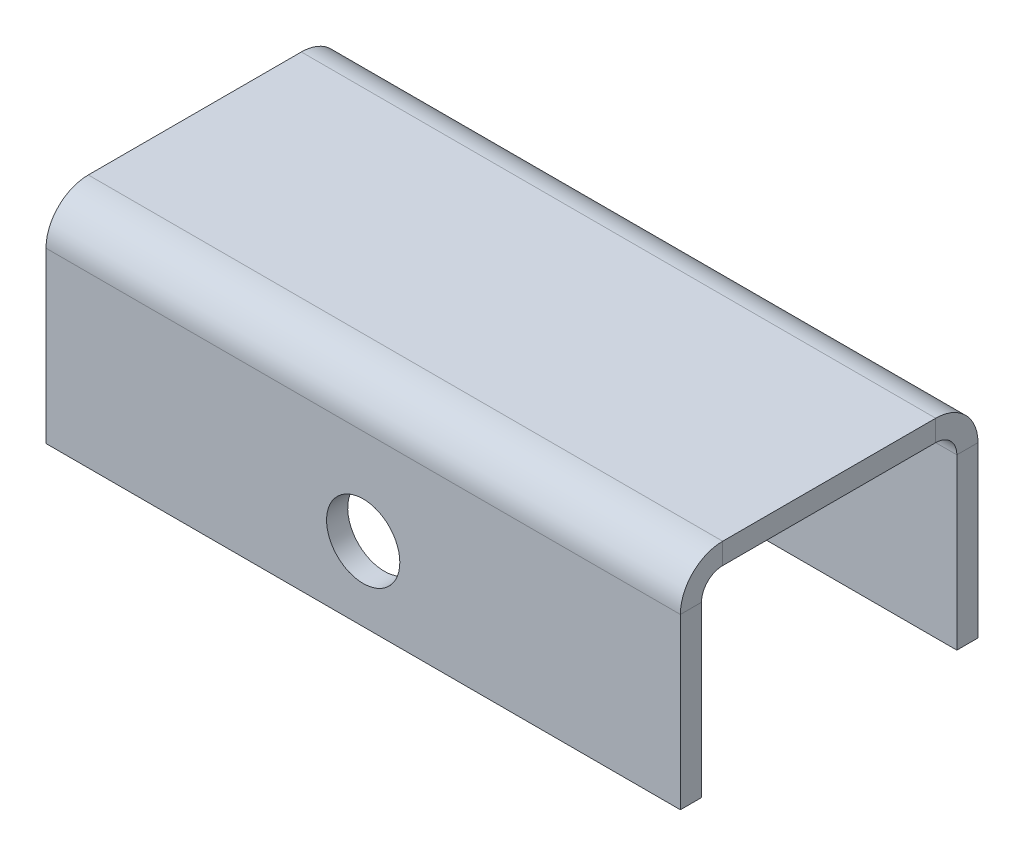
ISO-10303-21;
HEADER;
FILE_DESCRIPTION(('STEP AP214'),'2;1');
FILE_NAME('part.step','',(''),(''),'','','');
FILE_SCHEMA(('AUTOMOTIVE_DESIGN { 1 0 10303 214 1 1 1 1 }'));
ENDSEC;
DATA;
#1=APPLICATION_CONTEXT('core data for automotive mechanical design processes');
#2=APPLICATION_PROTOCOL_DEFINITION('international standard','automotive_design',2000,#1);
#3=PRODUCT_CONTEXT('',#1,'mechanical');
#4=PRODUCT('Part','Part','',(#3));
#5=PRODUCT_RELATED_PRODUCT_CATEGORY('part','',(#4));
#6=PRODUCT_DEFINITION_FORMATION('','',#4);
#7=PRODUCT_DEFINITION_CONTEXT('part definition',#1,'design');
#8=PRODUCT_DEFINITION('design','',#6,#7);
#9=PRODUCT_DEFINITION_SHAPE('','',#8);
#10=(LENGTH_UNIT() NAMED_UNIT(*) SI_UNIT(.MILLI.,.METRE.));
#11=(NAMED_UNIT(*) PLANE_ANGLE_UNIT() SI_UNIT($,.RADIAN.));
#12=(NAMED_UNIT(*) SI_UNIT($,.STERADIAN.) SOLID_ANGLE_UNIT());
#13=UNCERTAINTY_MEASURE_WITH_UNIT(LENGTH_MEASURE(1.E-05),#10,'distance_accuracy_value','');
#14=(GEOMETRIC_REPRESENTATION_CONTEXT(3) GLOBAL_UNCERTAINTY_ASSIGNED_CONTEXT((#13)) GLOBAL_UNIT_ASSIGNED_CONTEXT((#10,
#11,#12)) REPRESENTATION_CONTEXT('',''));
#15=CARTESIAN_POINT('',(0.,0.,0.));
#16=DIRECTION('',(0.,0.,1.));
#17=DIRECTION('',(1.,0.,0.));
#18=AXIS2_PLACEMENT_3D('',#15,#16,#17);
#19=CARTESIAN_POINT('',(0.,-2.54,0.));
#20=DIRECTION('',(0.,1.,0.));
#21=DIRECTION('',(0.,0.,1.));
#22=AXIS2_PLACEMENT_3D('',#19,#20,#21);
#23=PLANE('',#22);
#24=DIRECTION('',(1.,0.,0.));
#25=VECTOR('',#24,1.);
#26=CARTESIAN_POINT('',(75.2470588235294,-2.54,4.58735294117646));
#27=LINE('',#26,#25);
#28=CARTESIAN_POINT('',(75.2470588235294,-2.54,4.58735294117646));
#29=VERTEX_POINT('',#28);
#30=CARTESIAN_POINT('',(-0.952941176470587,-2.54000000000001,4.58735294117646));
#31=VERTEX_POINT('',#30);
#32=EDGE_CURVE('E224',#29,#31,#27,.F.);
#33=ORIENTED_EDGE('',*,*,#32,.F.);
#34=DIRECTION('',(0.,0.,-1.));
#35=VECTOR('',#34,1.);
#36=CARTESIAN_POINT('',(75.2470588235294,-2.54,-0.492647058823529));
#37=LINE('',#36,#35);
#38=CARTESIAN_POINT('',(75.2470588235294,-2.53999999999999,30.1773529411765));
#39=VERTEX_POINT('',#38);
#40=EDGE_CURVE('E13',#39,#29,#37,.T.);
#41=ORIENTED_EDGE('',*,*,#40,.F.);
#42=DIRECTION('',(-1.,0.,0.));
#43=VECTOR('',#42,1.);
#44=CARTESIAN_POINT('',(-0.952941176470587,-2.53999999999999,30.1773529411765));
#45=LINE('',#44,#43);
#46=CARTESIAN_POINT('',(-0.952941176470586,-2.53999999999999,30.1773529411765));
#47=VERTEX_POINT('',#46);
#48=EDGE_CURVE('E275',#47,#39,#45,.F.);
#49=ORIENTED_EDGE('',*,*,#48,.F.);
#50=DIRECTION('',(0.,0.,1.));
#51=VECTOR('',#50,1.);
#52=CARTESIAN_POINT('',(-0.952941176470588,-2.54,-0.492647058823529));
#53=LINE('',#52,#51);
#54=EDGE_CURVE('E88',#31,#47,#53,.T.);
#55=ORIENTED_EDGE('',*,*,#54,.F.);
#56=EDGE_LOOP('',(#33,#41,#49,#55));
#57=FACE_BOUND('',#56,.T.);
#58=ADVANCED_FACE('F79',(#57),#23,.F.);
#59=CARTESIAN_POINT('',(0.,0.,0.));
#60=DIRECTION('',(0.,1.,0.));
#61=DIRECTION('',(0.,0.,1.));
#62=AXIS2_PLACEMENT_3D('',#59,#60,#61);
#63=PLANE('',#62);
#64=DIRECTION('',(0.,0.,-1.));
#65=VECTOR('',#64,1.);
#66=CARTESIAN_POINT('',(75.2470588235294,0.,-0.492647058823529));
#67=LINE('',#66,#65);
#68=CARTESIAN_POINT('',(75.2470588235294,0.,30.1773529411765));
#69=VERTEX_POINT('',#68);
#70=CARTESIAN_POINT('',(75.2470588235294,0.,4.58735294117646));
#71=VERTEX_POINT('',#70);
#72=EDGE_CURVE('E285',#69,#71,#67,.T.);
#73=ORIENTED_EDGE('',*,*,#72,.T.);
#74=DIRECTION('',(1.,0.,0.));
#75=VECTOR('',#74,1.);
#76=CARTESIAN_POINT('',(75.2470588235294,0.,4.58735294117646));
#77=LINE('',#76,#75);
#78=CARTESIAN_POINT('',(-0.952941176470587,0.,4.58735294117646));
#79=VERTEX_POINT('',#78);
#80=EDGE_CURVE('E213',#71,#79,#77,.F.);
#81=ORIENTED_EDGE('',*,*,#80,.T.);
#82=DIRECTION('',(0.,0.,1.));
#83=VECTOR('',#82,1.);
#84=CARTESIAN_POINT('',(-0.952941176470588,0.,-0.492647058823529));
#85=LINE('',#84,#83);
#86=CARTESIAN_POINT('',(-0.952941176470586,0.,30.1773529411765));
#87=VERTEX_POINT('',#86);
#88=EDGE_CURVE('E281',#79,#87,#85,.T.);
#89=ORIENTED_EDGE('',*,*,#88,.T.);
#90=DIRECTION('',(-1.,0.,0.));
#91=VECTOR('',#90,1.);
#92=CARTESIAN_POINT('',(-0.952941176470587,0.,30.1773529411765));
#93=LINE('',#92,#91);
#94=EDGE_CURVE('E264',#87,#69,#93,.F.);
#95=ORIENTED_EDGE('',*,*,#94,.T.);
#96=EDGE_LOOP('',(#73,#81,#89,#95));
#97=FACE_BOUND('',#96,.T.);
#98=ADVANCED_FACE('F291',(#97),#63,.T.);
#99=CARTESIAN_POINT('',(75.2470588235294,-2.54,-0.492647058823529));
#100=DIRECTION('',(1.,0.,0.));
#101=DIRECTION('',(0.,0.,-1.));
#102=AXIS2_PLACEMENT_3D('',#99,#100,#101);
#103=PLANE('',#102);
#104=ORIENTED_EDGE('',*,*,#40,.T.);
#105=DIRECTION('',(0.,1.,0.));
#106=VECTOR('',#105,1.);
#107=CARTESIAN_POINT('',(75.2470588235294,-2.54,4.58735294117646));
#108=LINE('',#107,#106);
#109=EDGE_CURVE('E218',#29,#71,#108,.T.);
#110=ORIENTED_EDGE('',*,*,#109,.T.);
#111=ORIENTED_EDGE('',*,*,#72,.F.);
#112=DIRECTION('',(0.,1.,0.));
#113=VECTOR('',#112,1.);
#114=CARTESIAN_POINT('',(75.2470588235294,-2.53999999999999,30.1773529411765));
#115=LINE('',#114,#113);
#116=EDGE_CURVE('E279',#39,#69,#115,.T.);
#117=ORIENTED_EDGE('',*,*,#116,.F.);
#118=EDGE_LOOP('',(#104,#110,#111,#117));
#119=FACE_BOUND('',#118,.T.);
#120=ADVANCED_FACE('F295',(#119),#103,.T.);
#121=CARTESIAN_POINT('',(-0.952941176470588,-2.54,-0.492647058823529));
#122=DIRECTION('',(-1.,0.,0.));
#123=DIRECTION('',(0.,0.,1.));
#124=AXIS2_PLACEMENT_3D('',#121,#122,#123);
#125=PLANE('',#124);
#126=DIRECTION('',(0.,1.,0.));
#127=VECTOR('',#126,1.);
#128=CARTESIAN_POINT('',(-0.952941176470587,-2.54000000000001,4.58735294117646));
#129=LINE('',#128,#127);
#130=EDGE_CURVE('E229',#31,#79,#129,.T.);
#131=ORIENTED_EDGE('',*,*,#130,.F.);
#132=ORIENTED_EDGE('',*,*,#54,.T.);
#133=DIRECTION('',(0.,1.,0.));
#134=VECTOR('',#133,1.);
#135=CARTESIAN_POINT('',(-0.952941176470586,-2.53999999999999,30.1773529411765));
#136=LINE('',#135,#134);
#137=EDGE_CURVE('E269',#47,#87,#136,.T.);
#138=ORIENTED_EDGE('',*,*,#137,.T.);
#139=ORIENTED_EDGE('',*,*,#88,.F.);
#140=EDGE_LOOP('',(#131,#132,#138,#139));
#141=FACE_BOUND('',#140,.T.);
#142=ADVANCED_FACE('F81',(#141),#125,.T.);
#143=CARTESIAN_POINT('',(75.2470588235294,-5.07999999999999,30.1773529411765));
#144=DIRECTION('',(1.,0.,0.));
#145=DIRECTION('',(0.,0.,-1.));
#146=AXIS2_PLACEMENT_3D('',#143,#144,#145);
#147=PLANE('',#146);
#148=DIRECTION('',(0.,0.,-1.));
#149=VECTOR('',#148,1.);
#150=CARTESIAN_POINT('',(75.2470588235294,-5.07999999999999,35.2573529411765));
#151=LINE('',#150,#149);
#152=CARTESIAN_POINT('',(75.2470588235294,-5.07999999999998,32.7173529411765));
#153=VERTEX_POINT('',#152);
#154=CARTESIAN_POINT('',(75.2470588235294,-5.07999999999998,35.2573529411765));
#155=VERTEX_POINT('',#154);
#156=EDGE_CURVE('E231',#153,#155,#151,.F.);
#157=ORIENTED_EDGE('',*,*,#156,.F.);
#158=CARTESIAN_POINT('',(75.2470588235294,-5.07999999999999,30.1773529411765));
#159=DIRECTION('',(-1.,0.,0.));
#160=DIRECTION('',(0.,0.,1.));
#161=AXIS2_PLACEMENT_3D('',#158,#159,#160);
#162=CIRCLE('',#161,2.54);
#163=EDGE_CURVE('E272',#39,#153,#162,.F.);
#164=ORIENTED_EDGE('',*,*,#163,.F.);
#165=ORIENTED_EDGE('',*,*,#116,.T.);
#166=CARTESIAN_POINT('',(75.2470588235294,-5.07999999999999,30.1773529411765));
#167=DIRECTION('',(-1.,0.,0.));
#168=DIRECTION('',(0.,0.,1.));
#169=AXIS2_PLACEMENT_3D('',#166,#167,#168);
#170=CIRCLE('',#169,5.08);
#171=EDGE_CURVE('E96',#69,#155,#170,.F.);
#172=ORIENTED_EDGE('',*,*,#171,.T.);
#173=EDGE_LOOP('',(#157,#164,#165,#172));
#174=FACE_BOUND('',#173,.T.);
#175=ADVANCED_FACE('F341',(#174),#147,.T.);
#176=CARTESIAN_POINT('',(-0.952941176470586,-5.07999999999999,30.1773529411765));
#177=DIRECTION('',(1.,0.,0.));
#178=DIRECTION('',(0.,0.,-1.));
#179=AXIS2_PLACEMENT_3D('',#176,#177,#178);
#180=PLANE('',#179);
#181=CARTESIAN_POINT('',(-0.952941176470586,-5.07999999999999,30.1773529411765));
#182=DIRECTION('',(-1.,0.,0.));
#183=DIRECTION('',(0.,0.,1.));
#184=AXIS2_PLACEMENT_3D('',#181,#182,#183);
#185=CIRCLE('',#184,2.54);
#186=CARTESIAN_POINT('',(-0.952941176470586,-5.07999999999998,32.7173529411765));
#187=VERTEX_POINT('',#186);
#188=EDGE_CURVE('E237',#187,#47,#185,.T.);
#189=ORIENTED_EDGE('',*,*,#188,.F.);
#190=DIRECTION('',(0.,0.,-1.));
#191=VECTOR('',#190,1.);
#192=CARTESIAN_POINT('',(-0.952941176470587,-5.07999999999999,32.7173529411765));
#193=LINE('',#192,#191);
#194=CARTESIAN_POINT('',(-0.952941176470586,-5.07999999999999,35.2573529411765));
#195=VERTEX_POINT('',#194);
#196=EDGE_CURVE('E257',#187,#195,#193,.F.);
#197=ORIENTED_EDGE('',*,*,#196,.T.);
#198=CARTESIAN_POINT('',(-0.952941176470586,-5.07999999999999,30.1773529411765));
#199=DIRECTION('',(-1.,0.,0.));
#200=DIRECTION('',(0.,0.,1.));
#201=AXIS2_PLACEMENT_3D('',#198,#199,#200);
#202=CIRCLE('',#201,5.08);
#203=EDGE_CURVE('E267',#195,#87,#202,.T.);
#204=ORIENTED_EDGE('',*,*,#203,.T.);
#205=ORIENTED_EDGE('',*,*,#137,.F.);
#206=EDGE_LOOP('',(#189,#197,#204,#205));
#207=FACE_BOUND('',#206,.T.);
#208=ADVANCED_FACE('F335',(#207),#180,.F.);
#209=CARTESIAN_POINT('',(-0.952941176470587,-5.07999999999999,30.1773529411765));
#210=DIRECTION('',(-1.,0.,0.));
#211=DIRECTION('',(0.,0.,1.));
#212=AXIS2_PLACEMENT_3D('',#209,#210,#211);
#213=CYLINDRICAL_SURFACE('',#212,5.08);
#214=ORIENTED_EDGE('',*,*,#94,.F.);
#215=ORIENTED_EDGE('',*,*,#203,.F.);
#216=DIRECTION('',(-1.,0.,0.));
#217=VECTOR('',#216,1.);
#218=CARTESIAN_POINT('',(75.2470588235294,-5.07999999999999,35.2573529411765));
#219=LINE('',#218,#217);
#220=EDGE_CURVE('E255',#195,#155,#219,.F.);
#221=ORIENTED_EDGE('',*,*,#220,.T.);
#222=ORIENTED_EDGE('',*,*,#171,.F.);
#223=EDGE_LOOP('',(#214,#215,#221,#222));
#224=FACE_BOUND('',#223,.T.);
#225=ADVANCED_FACE('F349',(#224),#213,.T.);
#226=CARTESIAN_POINT('',(-0.952941176470587,-5.07999999999999,30.1773529411765));
#227=DIRECTION('',(-1.,0.,0.));
#228=DIRECTION('',(0.,0.,1.));
#229=AXIS2_PLACEMENT_3D('',#226,#227,#228);
#230=CYLINDRICAL_SURFACE('',#229,2.54);
#231=ORIENTED_EDGE('',*,*,#48,.T.);
#232=ORIENTED_EDGE('',*,*,#163,.T.);
#233=DIRECTION('',(-1.,0.,0.));
#234=VECTOR('',#233,1.);
#235=CARTESIAN_POINT('',(75.2470588235294,-5.07999999999999,32.7173529411765));
#236=LINE('',#235,#234);
#237=EDGE_CURVE('E260',#153,#187,#236,.T.);
#238=ORIENTED_EDGE('',*,*,#237,.T.);
#239=ORIENTED_EDGE('',*,*,#188,.T.);
#240=EDGE_LOOP('',(#231,#232,#238,#239));
#241=FACE_BOUND('',#240,.T.);
#242=ADVANCED_FACE('F352',(#241),#230,.F.);
#243=CARTESIAN_POINT('',(-0.95294117647057,-25.4,35.2573529411765));
#244=DIRECTION('',(1.,0.,0.));
#245=DIRECTION('',(0.,1.,0.));
#246=AXIS2_PLACEMENT_3D('',#243,#244,#245);
#247=PLANE('',#246);
#248=ORIENTED_EDGE('',*,*,#196,.F.);
#249=DIRECTION('',(0.,1.,0.));
#250=VECTOR('',#249,1.);
#251=CARTESIAN_POINT('',(-0.95294117647057,-25.4,32.7173529411766));
#252=LINE('',#251,#250);
#253=CARTESIAN_POINT('',(-0.952941176470572,-25.4,32.7173529411766));
#254=VERTEX_POINT('',#253);
#255=EDGE_CURVE('E253',#187,#254,#252,.F.);
#256=ORIENTED_EDGE('',*,*,#255,.T.);
#257=DIRECTION('',(0.,0.,-1.));
#258=VECTOR('',#257,1.);
#259=CARTESIAN_POINT('',(-0.952941176470573,-25.4,35.2573529411765));
#260=LINE('',#259,#258);
#261=CARTESIAN_POINT('',(-0.952941176470572,-25.4,35.2573529411765));
#262=VERTEX_POINT('',#261);
#263=EDGE_CURVE('E234',#262,#254,#260,.T.);
#264=ORIENTED_EDGE('',*,*,#263,.F.);
#265=DIRECTION('',(0.,-1.,0.));
#266=VECTOR('',#265,1.);
#267=CARTESIAN_POINT('',(-0.952941176470585,1.36727050943836E-13,35.2573529411765));
#268=LINE('',#267,#266);
#269=EDGE_CURVE('E246',#195,#262,#268,.T.);
#270=ORIENTED_EDGE('',*,*,#269,.F.);
#271=EDGE_LOOP('',(#248,#256,#264,#270));
#272=FACE_BOUND('',#271,.T.);
#273=ADVANCED_FACE('F355',(#272),#247,.F.);
#274=CARTESIAN_POINT('',(75.2470588235294,-2.53999999999999,35.2573529411765));
#275=DIRECTION('',(-1.,0.,0.));
#276=DIRECTION('',(0.,0.,1.));
#277=AXIS2_PLACEMENT_3D('',#274,#275,#276);
#278=PLANE('',#277);
#279=ORIENTED_EDGE('',*,*,#156,.T.);
#280=DIRECTION('',(0.,1.,0.));
#281=VECTOR('',#280,1.);
#282=CARTESIAN_POINT('',(75.2470588235294,1.37292001126349E-13,35.2573529411765));
#283=LINE('',#282,#281);
#284=CARTESIAN_POINT('',(75.2470588235294,-25.4,35.2573529411765));
#285=VERTEX_POINT('',#284);
#286=EDGE_CURVE('E241',#285,#155,#283,.T.);
#287=ORIENTED_EDGE('',*,*,#286,.F.);
#288=DIRECTION('',(0.,0.,-1.));
#289=VECTOR('',#288,1.);
#290=CARTESIAN_POINT('',(75.2470588235294,-25.4,35.2573529411765));
#291=LINE('',#290,#289);
#292=CARTESIAN_POINT('',(75.2470588235294,-25.4,32.7173529411766));
#293=VERTEX_POINT('',#292);
#294=EDGE_CURVE('E238',#285,#293,#291,.T.);
#295=ORIENTED_EDGE('',*,*,#294,.T.);
#296=DIRECTION('',(0.,-1.,0.));
#297=VECTOR('',#296,1.);
#298=CARTESIAN_POINT('',(75.2470588235294,-2.54,32.7173529411765));
#299=LINE('',#298,#297);
#300=EDGE_CURVE('E248',#293,#153,#299,.F.);
#301=ORIENTED_EDGE('',*,*,#300,.T.);
#302=EDGE_LOOP('',(#279,#287,#295,#301));
#303=FACE_BOUND('',#302,.T.);
#304=ADVANCED_FACE('F361',(#303),#278,.F.);
#305=CARTESIAN_POINT('',(0.,1.37292001126349E-13,35.2573529411765));
#306=DIRECTION('',(0.,0.,-1.));
#307=DIRECTION('',(0.,1.,0.));
#308=AXIS2_PLACEMENT_3D('',#305,#306,#307);
#309=PLANE('',#308);
#310=CARTESIAN_POINT('',(37.1470588235294,-16.51,35.2573529411765));
#311=DIRECTION('',(0.,0.,1.));
#312=DIRECTION('',(1.,0.,0.));
#313=AXIS2_PLACEMENT_3D('',#310,#311,#312);
#314=CIRCLE('',#313,4.4);
#315=CARTESIAN_POINT('',(41.5470588235294,-16.51,35.2573529411765));
#316=VERTEX_POINT('',#315);
#317=EDGE_CURVE('E628',#316,#316,#314,.T.);
#318=ORIENTED_EDGE('',*,*,#317,.F.);
#319=EDGE_LOOP('',(#318));
#320=FACE_BOUND('',#319,.T.);
#321=ORIENTED_EDGE('',*,*,#220,.F.);
#322=ORIENTED_EDGE('',*,*,#269,.T.);
#323=DIRECTION('',(1.,0.,0.));
#324=VECTOR('',#323,1.);
#325=CARTESIAN_POINT('',(0.,-25.4,35.2573529411765));
#326=LINE('',#325,#324);
#327=EDGE_CURVE('E244',#262,#285,#326,.T.);
#328=ORIENTED_EDGE('',*,*,#327,.T.);
#329=ORIENTED_EDGE('',*,*,#286,.T.);
#330=EDGE_LOOP('',(#321,#322,#328,#329));
#331=FACE_BOUND('',#330,.T.);
#332=ADVANCED_FACE('F370',(#320,#331),#309,.F.);
#333=CARTESIAN_POINT('',(0.,1.28423638525688E-13,32.7173529411765));
#334=DIRECTION('',(0.,0.,-1.));
#335=DIRECTION('',(0.,1.,0.));
#336=AXIS2_PLACEMENT_3D('',#333,#334,#335);
#337=PLANE('',#336);
#338=CARTESIAN_POINT('',(37.1470588235294,-16.51,32.7173529411765));
#339=DIRECTION('',(0.,0.,-1.));
#340=DIRECTION('',(0.,1.,0.));
#341=AXIS2_PLACEMENT_3D('',#338,#339,#340);
#342=CIRCLE('',#341,4.4);
#343=CARTESIAN_POINT('',(37.1470588235294,-12.11,32.7173529411765));
#344=VERTEX_POINT('',#343);
#345=EDGE_CURVE('E212',#344,#344,#342,.T.);
#346=ORIENTED_EDGE('',*,*,#345,.F.);
#347=EDGE_LOOP('',(#346));
#348=FACE_BOUND('',#347,.T.);
#349=ORIENTED_EDGE('',*,*,#255,.F.);
#350=ORIENTED_EDGE('',*,*,#237,.F.);
#351=ORIENTED_EDGE('',*,*,#300,.F.);
#352=DIRECTION('',(-1.,0.,0.));
#353=VECTOR('',#352,1.);
#354=CARTESIAN_POINT('',(75.2470588235294,-25.4,32.7173529411766));
#355=LINE('',#354,#353);
#356=EDGE_CURVE('E251',#254,#293,#355,.F.);
#357=ORIENTED_EDGE('',*,*,#356,.F.);
#358=EDGE_LOOP('',(#349,#350,#351,#357));
#359=FACE_BOUND('',#358,.T.);
#360=ADVANCED_FACE('F366',(#348,#359),#337,.T.);
#361=CARTESIAN_POINT('',(75.2470588235294,-25.4,35.2573529411765));
#362=DIRECTION('',(0.,1.,0.));
#363=DIRECTION('',(0.,0.,1.));
#364=AXIS2_PLACEMENT_3D('',#361,#362,#363);
#365=PLANE('',#364);
#366=ORIENTED_EDGE('',*,*,#356,.T.);
#367=ORIENTED_EDGE('',*,*,#294,.F.);
#368=ORIENTED_EDGE('',*,*,#327,.F.);
#369=ORIENTED_EDGE('',*,*,#263,.T.);
#370=EDGE_LOOP('',(#366,#367,#368,#369));
#371=FACE_BOUND('',#370,.T.);
#372=ADVANCED_FACE('F363',(#371),#365,.F.);
#373=CARTESIAN_POINT('',(-0.952941176470587,-5.08000000000001,4.58735294117646));
#374=DIRECTION('',(-1.,0.,0.));
#375=DIRECTION('',(0.,-1.,0.));
#376=AXIS2_PLACEMENT_3D('',#373,#374,#375);
#377=PLANE('',#376);
#378=DIRECTION('',(0.,0.,1.));
#379=VECTOR('',#378,1.);
#380=CARTESIAN_POINT('',(-0.952941176470588,-5.07999999999997,-0.492647058823547));
#381=LINE('',#380,#379);
#382=CARTESIAN_POINT('',(-0.952941176470587,-5.08000000000001,2.04735294117646));
#383=VERTEX_POINT('',#382);
#384=CARTESIAN_POINT('',(-0.952941176470587,-5.08,-0.492647058823538));
#385=VERTEX_POINT('',#384);
#386=EDGE_CURVE('E194',#383,#385,#381,.F.);
#387=ORIENTED_EDGE('',*,*,#386,.F.);
#388=CARTESIAN_POINT('',(-0.952941176470587,-5.08000000000001,4.58735294117646));
#389=DIRECTION('',(1.,0.,0.));
#390=DIRECTION('',(0.,1.,0.));
#391=AXIS2_PLACEMENT_3D('',#388,#389,#390);
#392=CIRCLE('',#391,2.54);
#393=EDGE_CURVE('E221',#31,#383,#392,.F.);
#394=ORIENTED_EDGE('',*,*,#393,.F.);
#395=ORIENTED_EDGE('',*,*,#130,.T.);
#396=CARTESIAN_POINT('',(-0.952941176470587,-5.08000000000001,4.58735294117646));
#397=DIRECTION('',(1.,0.,0.));
#398=DIRECTION('',(0.,1.,0.));
#399=AXIS2_PLACEMENT_3D('',#396,#397,#398);
#400=CIRCLE('',#399,5.08);
#401=EDGE_CURVE('E104',#79,#385,#400,.F.);
#402=ORIENTED_EDGE('',*,*,#401,.T.);
#403=EDGE_LOOP('',(#387,#394,#395,#402));
#404=FACE_BOUND('',#403,.T.);
#405=ADVANCED_FACE('F312',(#404),#377,.T.);
#406=CARTESIAN_POINT('',(75.2470588235294,-5.08,4.58735294117646));
#407=DIRECTION('',(-1.,0.,0.));
#408=DIRECTION('',(0.,-1.,0.));
#409=AXIS2_PLACEMENT_3D('',#406,#407,#408);
#410=PLANE('',#409);
#411=CARTESIAN_POINT('',(75.2470588235294,-5.08,4.58735294117646));
#412=DIRECTION('',(1.,0.,0.));
#413=DIRECTION('',(0.,1.,0.));
#414=AXIS2_PLACEMENT_3D('',#411,#412,#413);
#415=CIRCLE('',#414,2.54);
#416=CARTESIAN_POINT('',(75.2470588235294,-5.07999999999999,2.04735294117646));
#417=VERTEX_POINT('',#416);
#418=EDGE_CURVE('E226',#417,#29,#415,.T.);
#419=ORIENTED_EDGE('',*,*,#418,.F.);
#420=DIRECTION('',(0.,0.,1.));
#421=VECTOR('',#420,1.);
#422=CARTESIAN_POINT('',(75.2470588235294,-5.07999999999999,2.04735294117646));
#423=LINE('',#422,#421);
#424=CARTESIAN_POINT('',(75.2470588235294,-5.07999999999997,-0.492647058823538));
#425=VERTEX_POINT('',#424);
#426=EDGE_CURVE('E206',#417,#425,#423,.F.);
#427=ORIENTED_EDGE('',*,*,#426,.T.);
#428=CARTESIAN_POINT('',(75.2470588235294,-5.08,4.58735294117646));
#429=DIRECTION('',(1.,0.,0.));
#430=DIRECTION('',(0.,1.,0.));
#431=AXIS2_PLACEMENT_3D('',#428,#429,#430);
#432=CIRCLE('',#431,5.08);
#433=EDGE_CURVE('E216',#425,#71,#432,.T.);
#434=ORIENTED_EDGE('',*,*,#433,.T.);
#435=ORIENTED_EDGE('',*,*,#109,.F.);
#436=EDGE_LOOP('',(#419,#427,#434,#435));
#437=FACE_BOUND('',#436,.T.);
#438=ADVANCED_FACE('F299',(#437),#410,.F.);
#439=CARTESIAN_POINT('',(75.2470588235294,-5.08,4.58735294117646));
#440=DIRECTION('',(1.,0.,0.));
#441=DIRECTION('',(0.,0.,-1.));
#442=AXIS2_PLACEMENT_3D('',#439,#440,#441);
#443=CYLINDRICAL_SURFACE('',#442,5.08);
#444=ORIENTED_EDGE('',*,*,#80,.F.);
#445=ORIENTED_EDGE('',*,*,#433,.F.);
#446=DIRECTION('',(1.,0.,0.));
#447=VECTOR('',#446,1.);
#448=CARTESIAN_POINT('',(-0.952941176470588,-5.07999999999997,-0.492647058823538));
#449=LINE('',#448,#447);
#450=EDGE_CURVE('E204',#425,#385,#449,.F.);
#451=ORIENTED_EDGE('',*,*,#450,.T.);
#452=ORIENTED_EDGE('',*,*,#401,.F.);
#453=EDGE_LOOP('',(#444,#445,#451,#452));
#454=FACE_BOUND('',#453,.T.);
#455=ADVANCED_FACE('F318',(#454),#443,.T.);
#456=CARTESIAN_POINT('',(75.2470588235294,-5.08,4.58735294117646));
#457=DIRECTION('',(1.,0.,0.));
#458=DIRECTION('',(0.,0.,-1.));
#459=AXIS2_PLACEMENT_3D('',#456,#457,#458);
#460=CYLINDRICAL_SURFACE('',#459,2.54);
#461=ORIENTED_EDGE('',*,*,#32,.T.);
#462=ORIENTED_EDGE('',*,*,#393,.T.);
#463=DIRECTION('',(1.,0.,0.));
#464=VECTOR('',#463,1.);
#465=CARTESIAN_POINT('',(-0.952941176470588,-5.07999999999999,2.04735294117646));
#466=LINE('',#465,#464);
#467=EDGE_CURVE('E209',#383,#417,#466,.T.);
#468=ORIENTED_EDGE('',*,*,#467,.T.);
#469=ORIENTED_EDGE('',*,*,#418,.T.);
#470=EDGE_LOOP('',(#461,#462,#468,#469));
#471=FACE_BOUND('',#470,.T.);
#472=ADVANCED_FACE('F303',(#471),#460,.F.);
#473=CARTESIAN_POINT('',(75.2470588235294,-25.4,-0.492647058823609));
#474=DIRECTION('',(-1.,0.,0.));
#475=DIRECTION('',(0.,0.,1.));
#476=AXIS2_PLACEMENT_3D('',#473,#474,#475);
#477=PLANE('',#476);
#478=ORIENTED_EDGE('',*,*,#426,.F.);
#479=DIRECTION('',(0.,1.,0.));
#480=VECTOR('',#479,1.);
#481=CARTESIAN_POINT('',(75.2470588235294,-25.4,2.04735294117639));
#482=LINE('',#481,#480);
#483=CARTESIAN_POINT('',(75.2470588235294,-25.4,2.04735294117639));
#484=VERTEX_POINT('',#483);
#485=EDGE_CURVE('E202',#417,#484,#482,.F.);
#486=ORIENTED_EDGE('',*,*,#485,.T.);
#487=DIRECTION('',(0.,0.,1.));
#488=VECTOR('',#487,1.);
#489=CARTESIAN_POINT('',(75.2470588235294,-25.4,-0.492647058823609));
#490=LINE('',#489,#488);
#491=CARTESIAN_POINT('',(75.2470588235294,-25.4,-0.492647058823609));
#492=VERTEX_POINT('',#491);
#493=EDGE_CURVE('E190',#492,#484,#490,.T.);
#494=ORIENTED_EDGE('',*,*,#493,.F.);
#495=DIRECTION('',(0.,-1.,0.));
#496=VECTOR('',#495,1.);
#497=CARTESIAN_POINT('',(75.2470588235294,0.,-0.49264705882352));
#498=LINE('',#497,#496);
#499=EDGE_CURVE('E177',#425,#492,#498,.T.);
#500=ORIENTED_EDGE('',*,*,#499,.F.);
#501=EDGE_LOOP('',(#478,#486,#494,#500));
#502=FACE_BOUND('',#501,.T.);
#503=ADVANCED_FACE('F317',(#502),#477,.F.);
#504=CARTESIAN_POINT('',(-0.952941176470588,-2.53999999999999,-0.492647058823529));
#505=DIRECTION('',(1.,0.,0.));
#506=DIRECTION('',(0.,1.,0.));
#507=AXIS2_PLACEMENT_3D('',#504,#505,#506);
#508=PLANE('',#507);
#509=ORIENTED_EDGE('',*,*,#386,.T.);
#510=DIRECTION('',(0.,1.,0.));
#511=VECTOR('',#510,1.);
#512=CARTESIAN_POINT('',(-0.952941176470588,0.,-0.49264705882352));
#513=LINE('',#512,#511);
#514=CARTESIAN_POINT('',(-0.952941176470589,-25.4,-0.492647058823609));
#515=VERTEX_POINT('',#514);
#516=EDGE_CURVE('E175',#515,#385,#513,.T.);
#517=ORIENTED_EDGE('',*,*,#516,.F.);
#518=DIRECTION('',(0.,0.,1.));
#519=VECTOR('',#518,1.);
#520=CARTESIAN_POINT('',(-0.952941176470589,-25.4,-0.492647058823609));
#521=LINE('',#520,#519);
#522=CARTESIAN_POINT('',(-0.952941176470589,-25.4,2.04735294117639));
#523=VERTEX_POINT('',#522);
#524=EDGE_CURVE('E183',#515,#523,#521,.T.);
#525=ORIENTED_EDGE('',*,*,#524,.T.);
#526=DIRECTION('',(0.,-1.,0.));
#527=VECTOR('',#526,1.);
#528=CARTESIAN_POINT('',(-0.952941176470588,-2.54,2.04735294117647));
#529=LINE('',#528,#527);
#530=EDGE_CURVE('E199',#523,#383,#529,.F.);
#531=ORIENTED_EDGE('',*,*,#530,.T.);
#532=EDGE_LOOP('',(#509,#517,#525,#531));
#533=FACE_BOUND('',#532,.T.);
#534=ADVANCED_FACE('F193',(#533),#508,.F.);
#535=CARTESIAN_POINT('',(0.,0.,-0.49264705882352));
#536=DIRECTION('',(0.,0.,1.));
#537=DIRECTION('',(0.,-1.,0.));
#538=AXIS2_PLACEMENT_3D('',#535,#536,#537);
#539=PLANE('',#538);
#540=CARTESIAN_POINT('',(37.1470588235294,-16.51,-0.492647058823577));
#541=DIRECTION('',(0.,0.,1.));
#542=DIRECTION('',(0.,-1.,0.));
#543=AXIS2_PLACEMENT_3D('',#540,#541,#542);
#544=CIRCLE('',#543,4.4);
#545=CARTESIAN_POINT('',(37.1470588235294,-20.91,-0.492647058823592));
#546=VERTEX_POINT('',#545);
#547=EDGE_CURVE('E629',#546,#546,#544,.F.);
#548=ORIENTED_EDGE('',*,*,#547,.F.);
#549=EDGE_LOOP('',(#548));
#550=FACE_BOUND('',#549,.T.);
#551=ORIENTED_EDGE('',*,*,#450,.F.);
#552=ORIENTED_EDGE('',*,*,#499,.T.);
#553=DIRECTION('',(-1.,0.,0.));
#554=VECTOR('',#553,1.);
#555=CARTESIAN_POINT('',(0.,-25.4,-0.492647058823609));
#556=LINE('',#555,#554);
#557=EDGE_CURVE('E170',#492,#515,#556,.T.);
#558=ORIENTED_EDGE('',*,*,#557,.T.);
#559=ORIENTED_EDGE('',*,*,#516,.T.);
#560=EDGE_LOOP('',(#551,#552,#558,#559));
#561=FACE_BOUND('',#560,.T.);
#562=ADVANCED_FACE('F173',(#550,#561),#539,.F.);
#563=CARTESIAN_POINT('',(0.,0.,2.04735294117648));
#564=DIRECTION('',(0.,0.,1.));
#565=DIRECTION('',(0.,-1.,0.));
#566=AXIS2_PLACEMENT_3D('',#563,#564,#565);
#567=PLANE('',#566);
#568=CARTESIAN_POINT('',(37.1470588235294,-16.51,2.04735294117642));
#569=DIRECTION('',(0.,0.,1.));
#570=DIRECTION('',(0.,-1.,0.));
#571=AXIS2_PLACEMENT_3D('',#568,#569,#570);
#572=CIRCLE('',#571,4.4);
#573=CARTESIAN_POINT('',(37.1470588235294,-20.91,2.04735294117641));
#574=VERTEX_POINT('',#573);
#575=EDGE_CURVE('E83',#574,#574,#572,.T.);
#576=ORIENTED_EDGE('',*,*,#575,.F.);
#577=EDGE_LOOP('',(#576));
#578=FACE_BOUND('',#577,.T.);
#579=ORIENTED_EDGE('',*,*,#485,.F.);
#580=ORIENTED_EDGE('',*,*,#467,.F.);
#581=ORIENTED_EDGE('',*,*,#530,.F.);
#582=DIRECTION('',(1.,0.,0.));
#583=VECTOR('',#582,1.);
#584=CARTESIAN_POINT('',(-0.952941176470589,-25.4,2.04735294117639));
#585=LINE('',#584,#583);
#586=EDGE_CURVE('E186',#484,#523,#585,.F.);
#587=ORIENTED_EDGE('',*,*,#586,.F.);
#588=EDGE_LOOP('',(#579,#580,#581,#587));
#589=FACE_BOUND('',#588,.T.);
#590=ADVANCED_FACE('F315',(#578,#589),#567,.T.);
#591=CARTESIAN_POINT('',(-0.952941176470589,-25.4,-0.492647058823609));
#592=DIRECTION('',(0.,1.,0.));
#593=DIRECTION('',(0.,0.,1.));
#594=AXIS2_PLACEMENT_3D('',#591,#592,#593);
#595=PLANE('',#594);
#596=ORIENTED_EDGE('',*,*,#586,.T.);
#597=ORIENTED_EDGE('',*,*,#524,.F.);
#598=ORIENTED_EDGE('',*,*,#557,.F.);
#599=ORIENTED_EDGE('',*,*,#493,.T.);
#600=EDGE_LOOP('',(#596,#597,#598,#599));
#601=FACE_BOUND('',#600,.T.);
#602=ADVANCED_FACE('F184',(#601),#595,.F.);
#603=CARTESIAN_POINT('',(37.1470588235294,-16.51,35.2573529411765));
#604=DIRECTION('',(0.,0.,1.));
#605=DIRECTION('',(1.,0.,0.));
#606=AXIS2_PLACEMENT_3D('',#603,#604,#605);
#607=CYLINDRICAL_SURFACE('',#606,4.4);
#608=ORIENTED_EDGE('',*,*,#575,.T.);
#609=EDGE_LOOP('',(#608));
#610=FACE_BOUND('',#609,.T.);
#611=ORIENTED_EDGE('',*,*,#547,.T.);
#612=EDGE_LOOP('',(#611));
#613=FACE_BOUND('',#612,.T.);
#614=ADVANCED_FACE('F428',(#610,#613),#607,.F.);
#615=ORIENTED_EDGE('',*,*,#345,.T.);
#616=EDGE_LOOP('',(#615));
#617=FACE_BOUND('',#616,.T.);
#618=ORIENTED_EDGE('',*,*,#317,.T.);
#619=EDGE_LOOP('',(#618));
#620=FACE_BOUND('',#619,.T.);
#621=ADVANCED_FACE('F472',(#617,#620),#607,.F.);
#622=CLOSED_SHELL('',(#58,#98,#120,#142,#175,#208,#225,#242,#273,#304,#332,#360,#372,#405,#438,
#455,#472,#503,#534,#562,#590,#602,#614,#621));
#623=MANIFOLD_SOLID_BREP('B2',#622);
#624=ADVANCED_BREP_SHAPE_REPRESENTATION('',(#18,#623),#14);
#625=SHAPE_DEFINITION_REPRESENTATION(#9,#624);
ENDSEC;
END-ISO-10303-21;
